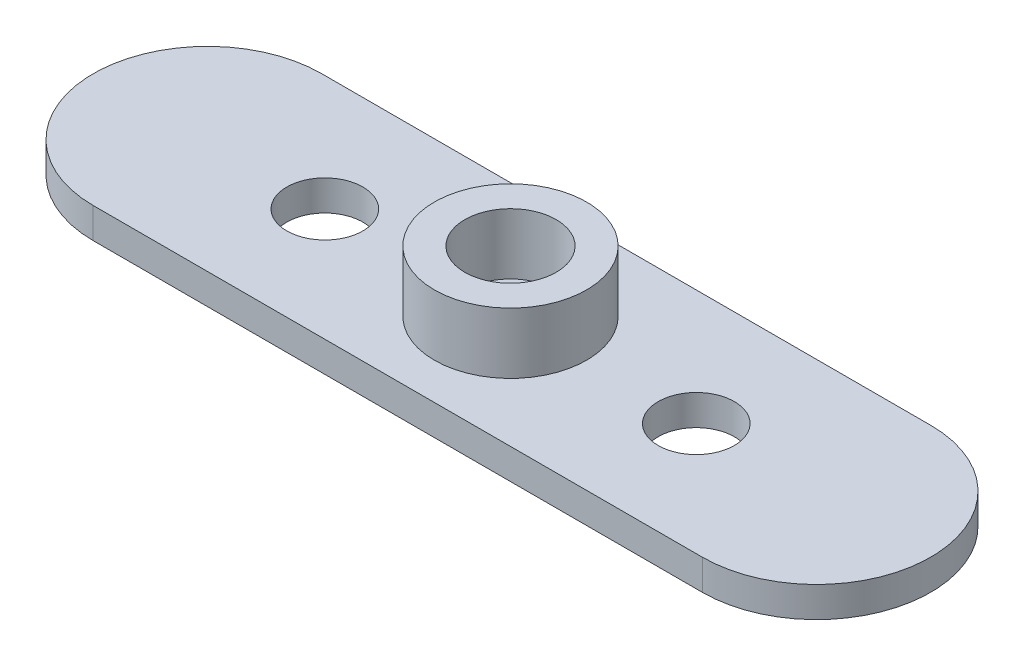
ISO-10303-21;
HEADER;
FILE_DESCRIPTION(('STEP AP214'),'2;1');
FILE_NAME('part.step','',(''),(''),'','','');
FILE_SCHEMA(('AUTOMOTIVE_DESIGN { 1 0 10303 214 1 1 1 1 }'));
ENDSEC;
DATA;
#1=APPLICATION_CONTEXT('core data for automotive mechanical design processes');
#2=APPLICATION_PROTOCOL_DEFINITION('international standard','automotive_design',2000,#1);
#3=PRODUCT_CONTEXT('',#1,'mechanical');
#4=PRODUCT('Part','Part','',(#3));
#5=PRODUCT_RELATED_PRODUCT_CATEGORY('part','',(#4));
#6=PRODUCT_DEFINITION_FORMATION('','',#4);
#7=PRODUCT_DEFINITION_CONTEXT('part definition',#1,'design');
#8=PRODUCT_DEFINITION('design','',#6,#7);
#9=PRODUCT_DEFINITION_SHAPE('','',#8);
#10=(LENGTH_UNIT() NAMED_UNIT(*) SI_UNIT(.MILLI.,.METRE.));
#11=(NAMED_UNIT(*) PLANE_ANGLE_UNIT() SI_UNIT($,.RADIAN.));
#12=(NAMED_UNIT(*) SI_UNIT($,.STERADIAN.) SOLID_ANGLE_UNIT());
#13=UNCERTAINTY_MEASURE_WITH_UNIT(LENGTH_MEASURE(1.E-05),#10,'distance_accuracy_value','');
#14=(GEOMETRIC_REPRESENTATION_CONTEXT(3) GLOBAL_UNCERTAINTY_ASSIGNED_CONTEXT((#13)) GLOBAL_UNIT_ASSIGNED_CONTEXT((#10,
#11,#12)) REPRESENTATION_CONTEXT('',''));
#15=CARTESIAN_POINT('',(0.,0.,0.));
#16=DIRECTION('',(0.,0.,1.));
#17=DIRECTION('',(1.,0.,0.));
#18=AXIS2_PLACEMENT_3D('',#15,#16,#17);
#19=CARTESIAN_POINT('',(-20.,2.,-0.098649922676933));
#20=DIRECTION('',(0.,-1.,0.));
#21=DIRECTION('',(0.,0.,-1.));
#22=AXIS2_PLACEMENT_3D('',#19,#20,#21);
#23=CYLINDRICAL_SURFACE('',#22,7.5);
#24=CARTESIAN_POINT('',(-20.,0.,-0.098649922676933));
#25=DIRECTION('',(0.,1.,0.));
#26=DIRECTION('',(0.,0.,1.));
#27=AXIS2_PLACEMENT_3D('',#24,#25,#26);
#28=CIRCLE('',#27,7.5);
#29=CARTESIAN_POINT('',(-20.,0.,-7.59864992267693));
#30=VERTEX_POINT('',#29);
#31=CARTESIAN_POINT('',(-20.,0.,7.40135007732306));
#32=VERTEX_POINT('',#31);
#33=EDGE_CURVE('E97',#30,#32,#28,.T.);
#34=ORIENTED_EDGE('',*,*,#33,.T.);
#35=DIRECTION('',(0.,-1.,0.));
#36=VECTOR('',#35,1.);
#37=CARTESIAN_POINT('',(-20.,2.,7.40135007732306));
#38=LINE('',#37,#36);
#39=CARTESIAN_POINT('',(-20.,2.,7.40135007732306));
#40=VERTEX_POINT('',#39);
#41=EDGE_CURVE('E11',#40,#32,#38,.T.);
#42=ORIENTED_EDGE('',*,*,#41,.F.);
#43=CARTESIAN_POINT('',(-20.,2.,-0.098649922676933));
#44=DIRECTION('',(0.,1.,0.));
#45=DIRECTION('',(0.,0.,1.));
#46=AXIS2_PLACEMENT_3D('',#43,#44,#45);
#47=CIRCLE('',#46,7.5);
#48=CARTESIAN_POINT('',(-20.,2.,-7.59864992267693));
#49=VERTEX_POINT('',#48);
#50=EDGE_CURVE('E85',#49,#40,#47,.T.);
#51=ORIENTED_EDGE('',*,*,#50,.F.);
#52=DIRECTION('',(0.,-1.,0.));
#53=VECTOR('',#52,1.);
#54=CARTESIAN_POINT('',(-20.,2.,-7.59864992267693));
#55=LINE('',#54,#53);
#56=EDGE_CURVE('E93',#49,#30,#55,.T.);
#57=ORIENTED_EDGE('',*,*,#56,.T.);
#58=EDGE_LOOP('',(#34,#42,#51,#57));
#59=FACE_BOUND('',#58,.T.);
#60=ADVANCED_FACE('F34',(#59),#23,.T.);
#61=CARTESIAN_POINT('',(-20.,2.,7.40135007732306));
#62=DIRECTION('',(0.,0.,-1.));
#63=DIRECTION('',(-1.,0.,0.));
#64=AXIS2_PLACEMENT_3D('',#61,#62,#63);
#65=PLANE('',#64);
#66=DIRECTION('',(1.,0.,0.));
#67=VECTOR('',#66,1.);
#68=CARTESIAN_POINT('',(-20.,0.,7.40135007732306));
#69=LINE('',#68,#67);
#70=CARTESIAN_POINT('',(20.,0.,7.40135007732305));
#71=VERTEX_POINT('',#70);
#72=EDGE_CURVE('E89',#32,#71,#69,.T.);
#73=ORIENTED_EDGE('',*,*,#72,.T.);
#74=DIRECTION('',(0.,-1.,0.));
#75=VECTOR('',#74,1.);
#76=CARTESIAN_POINT('',(20.,2.,7.40135007732305));
#77=LINE('',#76,#75);
#78=CARTESIAN_POINT('',(20.,2.,7.40135007732305));
#79=VERTEX_POINT('',#78);
#80=EDGE_CURVE('E42',#79,#71,#77,.T.);
#81=ORIENTED_EDGE('',*,*,#80,.F.);
#82=DIRECTION('',(1.,0.,0.));
#83=VECTOR('',#82,1.);
#84=CARTESIAN_POINT('',(-20.,2.,7.40135007732306));
#85=LINE('',#84,#83);
#86=EDGE_CURVE('E80',#40,#79,#85,.T.);
#87=ORIENTED_EDGE('',*,*,#86,.F.);
#88=ORIENTED_EDGE('',*,*,#41,.T.);
#89=EDGE_LOOP('',(#73,#81,#87,#88));
#90=FACE_BOUND('',#89,.T.);
#91=ADVANCED_FACE('F88',(#90),#65,.F.);
#92=CARTESIAN_POINT('',(20.,2.,-0.0986499226769379));
#93=DIRECTION('',(0.,-1.,0.));
#94=DIRECTION('',(0.,0.,-1.));
#95=AXIS2_PLACEMENT_3D('',#92,#93,#94);
#96=CYLINDRICAL_SURFACE('',#95,7.49999999999999);
#97=CARTESIAN_POINT('',(20.,0.,-0.0986499226769379));
#98=DIRECTION('',(0.,1.,0.));
#99=DIRECTION('',(0.,0.,1.));
#100=AXIS2_PLACEMENT_3D('',#97,#98,#99);
#101=CIRCLE('',#100,7.49999999999999);
#102=CARTESIAN_POINT('',(20.,0.,-7.59864992267693));
#103=VERTEX_POINT('',#102);
#104=EDGE_CURVE('E67',#71,#103,#101,.T.);
#105=ORIENTED_EDGE('',*,*,#104,.T.);
#106=DIRECTION('',(0.,-1.,0.));
#107=VECTOR('',#106,1.);
#108=CARTESIAN_POINT('',(20.,2.,-7.59864992267693));
#109=LINE('',#108,#107);
#110=CARTESIAN_POINT('',(20.,2.,-7.59864992267693));
#111=VERTEX_POINT('',#110);
#112=EDGE_CURVE('E90',#111,#103,#109,.T.);
#113=ORIENTED_EDGE('',*,*,#112,.F.);
#114=CARTESIAN_POINT('',(20.,2.,-0.0986499226769379));
#115=DIRECTION('',(0.,1.,0.));
#116=DIRECTION('',(0.,0.,1.));
#117=AXIS2_PLACEMENT_3D('',#114,#115,#116);
#118=CIRCLE('',#117,7.49999999999999);
#119=EDGE_CURVE('E83',#79,#111,#118,.T.);
#120=ORIENTED_EDGE('',*,*,#119,.F.);
#121=ORIENTED_EDGE('',*,*,#80,.T.);
#122=EDGE_LOOP('',(#105,#113,#120,#121));
#123=FACE_BOUND('',#122,.T.);
#124=ADVANCED_FACE('F91',(#123),#96,.T.);
#125=CARTESIAN_POINT('',(-20.,2.,-7.59864992267693));
#126=DIRECTION('',(0.,0.,1.));
#127=DIRECTION('',(1.,0.,0.));
#128=AXIS2_PLACEMENT_3D('',#125,#126,#127);
#129=PLANE('',#128);
#130=DIRECTION('',(-1.,0.,0.));
#131=VECTOR('',#130,1.);
#132=CARTESIAN_POINT('',(-20.,0.,-7.59864992267693));
#133=LINE('',#132,#131);
#134=EDGE_CURVE('E73',#103,#30,#133,.T.);
#135=ORIENTED_EDGE('',*,*,#134,.T.);
#136=ORIENTED_EDGE('',*,*,#56,.F.);
#137=DIRECTION('',(-1.,0.,0.));
#138=VECTOR('',#137,1.);
#139=CARTESIAN_POINT('',(-20.,2.,-7.59864992267693));
#140=LINE('',#139,#138);
#141=EDGE_CURVE('E50',#111,#49,#140,.T.);
#142=ORIENTED_EDGE('',*,*,#141,.F.);
#143=ORIENTED_EDGE('',*,*,#112,.T.);
#144=EDGE_LOOP('',(#135,#136,#142,#143));
#145=FACE_BOUND('',#144,.T.);
#146=ADVANCED_FACE('F105',(#145),#129,.F.);
#147=CARTESIAN_POINT('',(-20.,2.,-0.098649922676933));
#148=DIRECTION('',(0.,1.,0.));
#149=DIRECTION('',(0.,0.,1.));
#150=AXIS2_PLACEMENT_3D('',#147,#148,#149);
#151=PLANE('',#150);
#152=CARTESIAN_POINT('',(12.2,2.,0.));
#153=DIRECTION('',(0.,1.,0.));
#154=DIRECTION('',(0.,0.,1.));
#155=AXIS2_PLACEMENT_3D('',#152,#153,#154);
#156=CIRCLE('',#155,2.5);
#157=CARTESIAN_POINT('',(12.2,2.,2.5));
#158=VERTEX_POINT('',#157);
#159=EDGE_CURVE('E135',#158,#158,#156,.T.);
#160=ORIENTED_EDGE('',*,*,#159,.F.);
#161=EDGE_LOOP('',(#160));
#162=FACE_BOUND('',#161,.T.);
#163=CARTESIAN_POINT('',(-12.2,2.,-0.00904672314661162));
#164=DIRECTION('',(0.,1.,0.));
#165=DIRECTION('',(0.,0.,1.));
#166=AXIS2_PLACEMENT_3D('',#163,#164,#165);
#167=CIRCLE('',#166,2.5);
#168=CARTESIAN_POINT('',(-12.2,2.,2.49095327685339));
#169=VERTEX_POINT('',#168);
#170=EDGE_CURVE('E129',#169,#169,#167,.T.);
#171=ORIENTED_EDGE('',*,*,#170,.F.);
#172=EDGE_LOOP('',(#171));
#173=FACE_BOUND('',#172,.T.);
#174=CARTESIAN_POINT('',(0.,2.,0.));
#175=DIRECTION('',(0.,1.,0.));
#176=DIRECTION('',(0.,0.,1.));
#177=AXIS2_PLACEMENT_3D('',#174,#175,#176);
#178=CIRCLE('',#177,5.);
#179=CARTESIAN_POINT('',(0.,2.,5.));
#180=VERTEX_POINT('',#179);
#181=EDGE_CURVE('E111',#180,#180,#178,.T.);
#182=ORIENTED_EDGE('',*,*,#181,.F.);
#183=EDGE_LOOP('',(#182));
#184=FACE_BOUND('',#183,.T.);
#185=ORIENTED_EDGE('',*,*,#50,.T.);
#186=ORIENTED_EDGE('',*,*,#86,.T.);
#187=ORIENTED_EDGE('',*,*,#119,.T.);
#188=ORIENTED_EDGE('',*,*,#141,.T.);
#189=EDGE_LOOP('',(#185,#186,#187,#188));
#190=FACE_BOUND('',#189,.T.);
#191=ADVANCED_FACE('F81',(#162,#173,#184,#190),#151,.T.);
#192=CARTESIAN_POINT('',(-20.,0.,-0.098649922676933));
#193=DIRECTION('',(0.,1.,0.));
#194=DIRECTION('',(0.,0.,1.));
#195=AXIS2_PLACEMENT_3D('',#192,#193,#194);
#196=PLANE('',#195);
#197=CARTESIAN_POINT('',(12.2,0.,0.));
#198=DIRECTION('',(0.,1.,0.));
#199=DIRECTION('',(0.,0.,1.));
#200=AXIS2_PLACEMENT_3D('',#197,#198,#199);
#201=CIRCLE('',#200,2.5);
#202=CARTESIAN_POINT('',(12.2,0.,2.5));
#203=VERTEX_POINT('',#202);
#204=EDGE_CURVE('E132',#203,#203,#201,.T.);
#205=ORIENTED_EDGE('',*,*,#204,.T.);
#206=EDGE_LOOP('',(#205));
#207=FACE_BOUND('',#206,.T.);
#208=CARTESIAN_POINT('',(-12.2,0.,-0.00904672314661162));
#209=DIRECTION('',(0.,1.,0.));
#210=DIRECTION('',(0.,0.,1.));
#211=AXIS2_PLACEMENT_3D('',#208,#209,#210);
#212=CIRCLE('',#211,2.5);
#213=CARTESIAN_POINT('',(-12.2,0.,2.49095327685339));
#214=VERTEX_POINT('',#213);
#215=EDGE_CURVE('E126',#214,#214,#212,.T.);
#216=ORIENTED_EDGE('',*,*,#215,.T.);
#217=EDGE_LOOP('',(#216));
#218=FACE_BOUND('',#217,.T.);
#219=CARTESIAN_POINT('',(0.,0.,0.));
#220=DIRECTION('',(0.,1.,0.));
#221=DIRECTION('',(0.,0.,1.));
#222=AXIS2_PLACEMENT_3D('',#219,#220,#221);
#223=CIRCLE('',#222,1.5);
#224=CARTESIAN_POINT('',(0.,0.,1.5));
#225=VERTEX_POINT('',#224);
#226=EDGE_CURVE('E122',#225,#225,#223,.T.);
#227=ORIENTED_EDGE('',*,*,#226,.T.);
#228=EDGE_LOOP('',(#227));
#229=FACE_BOUND('',#228,.T.);
#230=ORIENTED_EDGE('',*,*,#33,.F.);
#231=ORIENTED_EDGE('',*,*,#134,.F.);
#232=ORIENTED_EDGE('',*,*,#104,.F.);
#233=ORIENTED_EDGE('',*,*,#72,.F.);
#234=EDGE_LOOP('',(#230,#231,#232,#233));
#235=FACE_BOUND('',#234,.T.);
#236=ADVANCED_FACE('F108',(#207,#218,#229,#235),#196,.F.);
#237=CARTESIAN_POINT('',(0.,6.,0.));
#238=DIRECTION('',(0.,-1.,0.));
#239=DIRECTION('',(0.,0.,-1.));
#240=AXIS2_PLACEMENT_3D('',#237,#238,#239);
#241=CYLINDRICAL_SURFACE('',#240,5.);
#242=CARTESIAN_POINT('',(0.,6.,0.));
#243=DIRECTION('',(0.,1.,0.));
#244=DIRECTION('',(0.,0.,1.));
#245=AXIS2_PLACEMENT_3D('',#242,#243,#244);
#246=CIRCLE('',#245,5.);
#247=CARTESIAN_POINT('',(0.,6.,5.));
#248=VERTEX_POINT('',#247);
#249=EDGE_CURVE('E100',#248,#248,#246,.T.);
#250=ORIENTED_EDGE('',*,*,#249,.F.);
#251=EDGE_LOOP('',(#250));
#252=FACE_BOUND('',#251,.T.);
#253=ORIENTED_EDGE('',*,*,#181,.T.);
#254=EDGE_LOOP('',(#253));
#255=FACE_BOUND('',#254,.T.);
#256=ADVANCED_FACE('F157',(#252,#255),#241,.T.);
#257=CARTESIAN_POINT('',(0.,6.,0.));
#258=DIRECTION('',(0.,1.,0.));
#259=DIRECTION('',(0.,0.,1.));
#260=AXIS2_PLACEMENT_3D('',#257,#258,#259);
#261=PLANE('',#260);
#262=CARTESIAN_POINT('',(0.,6.,0.));
#263=DIRECTION('',(0.,1.,0.));
#264=DIRECTION('',(0.,0.,1.));
#265=AXIS2_PLACEMENT_3D('',#262,#263,#264);
#266=CIRCLE('',#265,3.);
#267=CARTESIAN_POINT('',(0.,6.,3.));
#268=VERTEX_POINT('',#267);
#269=EDGE_CURVE('E119',#268,#268,#266,.T.);
#270=ORIENTED_EDGE('',*,*,#269,.F.);
#271=EDGE_LOOP('',(#270));
#272=FACE_BOUND('',#271,.T.);
#273=ORIENTED_EDGE('',*,*,#249,.T.);
#274=EDGE_LOOP('',(#273));
#275=FACE_BOUND('',#274,.T.);
#276=ADVANCED_FACE('F159',(#272,#275),#261,.T.);
#277=CARTESIAN_POINT('',(0.,-6.48528137423857,0.));
#278=DIRECTION('',(0.,1.,0.));
#279=DIRECTION('',(0.,0.,1.));
#280=AXIS2_PLACEMENT_3D('',#277,#278,#279);
#281=CYLINDRICAL_SURFACE('',#280,3.);
#282=CARTESIAN_POINT('',(0.,2.,0.));
#283=DIRECTION('',(0.,1.,0.));
#284=DIRECTION('',(0.,0.,1.));
#285=AXIS2_PLACEMENT_3D('',#282,#283,#284);
#286=CIRCLE('',#285,3.);
#287=CARTESIAN_POINT('',(0.,2.,3.));
#288=VERTEX_POINT('',#287);
#289=EDGE_CURVE('E114',#288,#288,#286,.F.);
#290=ORIENTED_EDGE('',*,*,#289,.T.);
#291=EDGE_LOOP('',(#290));
#292=FACE_BOUND('',#291,.T.);
#293=ORIENTED_EDGE('',*,*,#269,.T.);
#294=EDGE_LOOP('',(#293));
#295=FACE_BOUND('',#294,.T.);
#296=ADVANCED_FACE('F166',(#292,#295),#281,.F.);
#297=CARTESIAN_POINT('',(-20.,2.,-0.098649922676933));
#298=DIRECTION('',(0.,1.,0.));
#299=DIRECTION('',(0.,0.,1.));
#300=AXIS2_PLACEMENT_3D('',#297,#298,#299);
#301=PLANE('',#300);
#302=CARTESIAN_POINT('',(0.,2.,0.));
#303=DIRECTION('',(0.,1.,0.));
#304=DIRECTION('',(0.,0.,1.));
#305=AXIS2_PLACEMENT_3D('',#302,#303,#304);
#306=CIRCLE('',#305,1.5);
#307=CARTESIAN_POINT('',(0.,2.,1.5));
#308=VERTEX_POINT('',#307);
#309=EDGE_CURVE('E123',#308,#308,#306,.T.);
#310=ORIENTED_EDGE('',*,*,#309,.F.);
#311=EDGE_LOOP('',(#310));
#312=FACE_BOUND('',#311,.T.);
#313=ORIENTED_EDGE('',*,*,#289,.F.);
#314=EDGE_LOOP('',(#313));
#315=FACE_BOUND('',#314,.T.);
#316=ADVANCED_FACE('F216',(#312,#315),#301,.T.);
#317=CARTESIAN_POINT('',(0.,0.,0.));
#318=DIRECTION('',(0.,1.,0.));
#319=DIRECTION('',(0.,0.,1.));
#320=AXIS2_PLACEMENT_3D('',#317,#318,#319);
#321=CYLINDRICAL_SURFACE('',#320,1.5);
#322=ORIENTED_EDGE('',*,*,#226,.F.);
#323=EDGE_LOOP('',(#322));
#324=FACE_BOUND('',#323,.T.);
#325=ORIENTED_EDGE('',*,*,#309,.T.);
#326=EDGE_LOOP('',(#325));
#327=FACE_BOUND('',#326,.T.);
#328=ADVANCED_FACE('F209',(#324,#327),#321,.F.);
#329=CARTESIAN_POINT('',(-12.2,0.,-0.00904672314661162));
#330=DIRECTION('',(0.,1.,0.));
#331=DIRECTION('',(0.,0.,1.));
#332=AXIS2_PLACEMENT_3D('',#329,#330,#331);
#333=CYLINDRICAL_SURFACE('',#332,2.5);
#334=ORIENTED_EDGE('',*,*,#215,.F.);
#335=EDGE_LOOP('',(#334));
#336=FACE_BOUND('',#335,.T.);
#337=ORIENTED_EDGE('',*,*,#170,.T.);
#338=EDGE_LOOP('',(#337));
#339=FACE_BOUND('',#338,.T.);
#340=ADVANCED_FACE('F146',(#336,#339),#333,.F.);
#341=CARTESIAN_POINT('',(12.2,0.,0.));
#342=DIRECTION('',(0.,1.,0.));
#343=DIRECTION('',(0.,0.,1.));
#344=AXIS2_PLACEMENT_3D('',#341,#342,#343);
#345=CYLINDRICAL_SURFACE('',#344,2.5);
#346=ORIENTED_EDGE('',*,*,#204,.F.);
#347=EDGE_LOOP('',(#346));
#348=FACE_BOUND('',#347,.T.);
#349=ORIENTED_EDGE('',*,*,#159,.T.);
#350=EDGE_LOOP('',(#349));
#351=FACE_BOUND('',#350,.T.);
#352=ADVANCED_FACE('F143',(#348,#351),#345,.F.);
#353=CLOSED_SHELL('',(#60,#91,#124,#146,#191,#236,#256,#276,#296,#316,#328,#340,#352));
#354=MANIFOLD_SOLID_BREP('B2',#353);
#355=ADVANCED_BREP_SHAPE_REPRESENTATION('',(#18,#354),#14);
#356=SHAPE_DEFINITION_REPRESENTATION(#9,#355);
ENDSEC;
END-ISO-10303-21;
